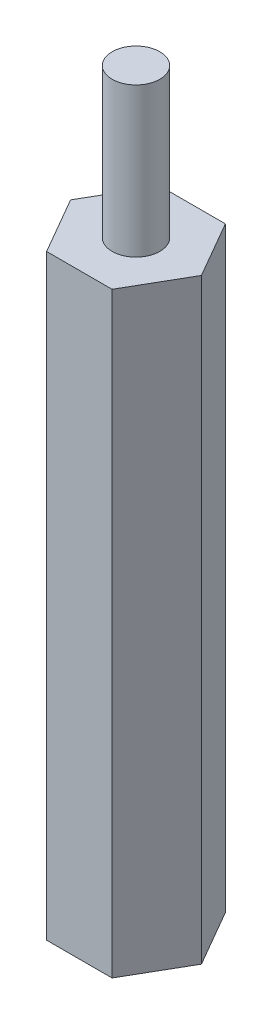
ISO-10303-21;
HEADER;
FILE_DESCRIPTION(('STEP AP214'),'2;1');
FILE_NAME('part.step','',(''),(''),'','','');
FILE_SCHEMA(('AUTOMOTIVE_DESIGN { 1 0 10303 214 1 1 1 1 }'));
ENDSEC;
DATA;
#1=APPLICATION_CONTEXT('core data for automotive mechanical design processes');
#2=APPLICATION_PROTOCOL_DEFINITION('international standard','automotive_design',2000,#1);
#3=PRODUCT_CONTEXT('',#1,'mechanical');
#4=PRODUCT('Part','Part','',(#3));
#5=PRODUCT_RELATED_PRODUCT_CATEGORY('part','',(#4));
#6=PRODUCT_DEFINITION_FORMATION('','',#4);
#7=PRODUCT_DEFINITION_CONTEXT('part definition',#1,'design');
#8=PRODUCT_DEFINITION('design','',#6,#7);
#9=PRODUCT_DEFINITION_SHAPE('','',#8);
#10=(LENGTH_UNIT() NAMED_UNIT(*) SI_UNIT(.MILLI.,.METRE.));
#11=(NAMED_UNIT(*) PLANE_ANGLE_UNIT() SI_UNIT($,.RADIAN.));
#12=(NAMED_UNIT(*) SI_UNIT($,.STERADIAN.) SOLID_ANGLE_UNIT());
#13=UNCERTAINTY_MEASURE_WITH_UNIT(LENGTH_MEASURE(1.E-05),#10,'distance_accuracy_value','');
#14=(GEOMETRIC_REPRESENTATION_CONTEXT(3) GLOBAL_UNCERTAINTY_ASSIGNED_CONTEXT((#13)) GLOBAL_UNIT_ASSIGNED_CONTEXT((#10,
#11,#12)) REPRESENTATION_CONTEXT('',''));
#15=CARTESIAN_POINT('',(0.,0.,0.));
#16=DIRECTION('',(0.,0.,1.));
#17=DIRECTION('',(1.,0.,0.));
#18=AXIS2_PLACEMENT_3D('',#15,#16,#17);
#19=CARTESIAN_POINT('',(-1.39314619955457,25.4,2.413));
#20=DIRECTION('',(0.,0.,-1.));
#21=DIRECTION('',(-1.,0.,0.));
#22=AXIS2_PLACEMENT_3D('',#19,#20,#21);
#23=PLANE('',#22);
#24=DIRECTION('',(1.,0.,0.));
#25=VECTOR('',#24,1.);
#26=CARTESIAN_POINT('',(-1.39314619955457,0.,2.413));
#27=LINE('',#26,#25);
#28=CARTESIAN_POINT('',(-1.39314619955457,0.,2.413));
#29=VERTEX_POINT('',#28);
#30=CARTESIAN_POINT('',(1.39314619955457,0.,2.413));
#31=VERTEX_POINT('',#30);
#32=EDGE_CURVE('E120',#29,#31,#27,.T.);
#33=ORIENTED_EDGE('',*,*,#32,.T.);
#34=DIRECTION('',(0.,-1.,0.));
#35=VECTOR('',#34,1.);
#36=CARTESIAN_POINT('',(1.39314619955457,25.4,2.413));
#37=LINE('',#36,#35);
#38=CARTESIAN_POINT('',(1.39314619955457,25.4,2.413));
#39=VERTEX_POINT('',#38);
#40=EDGE_CURVE('E37',#39,#31,#37,.T.);
#41=ORIENTED_EDGE('',*,*,#40,.F.);
#42=DIRECTION('',(1.,0.,0.));
#43=VECTOR('',#42,1.);
#44=CARTESIAN_POINT('',(-1.39314619955457,25.4,2.413));
#45=LINE('',#44,#43);
#46=CARTESIAN_POINT('',(-1.39314619955457,25.4,2.413));
#47=VERTEX_POINT('',#46);
#48=EDGE_CURVE('E131',#47,#39,#45,.T.);
#49=ORIENTED_EDGE('',*,*,#48,.F.);
#50=DIRECTION('',(0.,-1.,0.));
#51=VECTOR('',#50,1.);
#52=CARTESIAN_POINT('',(-1.39314619955457,25.4,2.413));
#53=LINE('',#52,#51);
#54=EDGE_CURVE('E116',#47,#29,#53,.T.);
#55=ORIENTED_EDGE('',*,*,#54,.T.);
#56=EDGE_LOOP('',(#33,#41,#49,#55));
#57=FACE_BOUND('',#56,.T.);
#58=ADVANCED_FACE('F34',(#57),#23,.F.);
#59=CARTESIAN_POINT('',(1.39314619955457,25.4,2.413));
#60=DIRECTION('',(-0.866025403784438,0.,-0.5));
#61=DIRECTION('',(-0.5,0.,0.866025403784439));
#62=AXIS2_PLACEMENT_3D('',#59,#60,#61);
#63=PLANE('',#62);
#64=DIRECTION('',(0.5,0.,-0.866025403784439));
#65=VECTOR('',#64,1.);
#66=CARTESIAN_POINT('',(1.39314619955457,0.,2.413));
#67=LINE('',#66,#65);
#68=CARTESIAN_POINT('',(2.78629239910913,0.,0.));
#69=VERTEX_POINT('',#68);
#70=EDGE_CURVE('E123',#31,#69,#67,.T.);
#71=ORIENTED_EDGE('',*,*,#70,.T.);
#72=DIRECTION('',(0.,-1.,0.));
#73=VECTOR('',#72,1.);
#74=CARTESIAN_POINT('',(2.78629239910913,25.4,0.));
#75=LINE('',#74,#73);
#76=CARTESIAN_POINT('',(2.78629239910913,25.4,0.));
#77=VERTEX_POINT('',#76);
#78=EDGE_CURVE('E134',#77,#69,#75,.T.);
#79=ORIENTED_EDGE('',*,*,#78,.F.);
#80=DIRECTION('',(0.5,0.,-0.866025403784439));
#81=VECTOR('',#80,1.);
#82=CARTESIAN_POINT('',(1.39314619955457,25.4,2.413));
#83=LINE('',#82,#81);
#84=EDGE_CURVE('E89',#39,#77,#83,.T.);
#85=ORIENTED_EDGE('',*,*,#84,.F.);
#86=ORIENTED_EDGE('',*,*,#40,.T.);
#87=EDGE_LOOP('',(#71,#79,#85,#86));
#88=FACE_BOUND('',#87,.T.);
#89=ADVANCED_FACE('F139',(#88),#63,.F.);
#90=CARTESIAN_POINT('',(2.78629239910913,25.4,0.));
#91=DIRECTION('',(-0.866025403784439,0.,0.5));
#92=DIRECTION('',(0.5,0.,0.866025403784439));
#93=AXIS2_PLACEMENT_3D('',#90,#91,#92);
#94=PLANE('',#93);
#95=DIRECTION('',(-0.5,0.,-0.866025403784439));
#96=VECTOR('',#95,1.);
#97=CARTESIAN_POINT('',(2.78629239910913,0.,0.));
#98=LINE('',#97,#96);
#99=CARTESIAN_POINT('',(1.39314619955457,0.,-2.413));
#100=VERTEX_POINT('',#99);
#101=EDGE_CURVE('E126',#69,#100,#98,.T.);
#102=ORIENTED_EDGE('',*,*,#101,.T.);
#103=DIRECTION('',(0.,-1.,0.));
#104=VECTOR('',#103,1.);
#105=CARTESIAN_POINT('',(1.39314619955457,25.4,-2.413));
#106=LINE('',#105,#104);
#107=CARTESIAN_POINT('',(1.39314619955457,25.4,-2.413));
#108=VERTEX_POINT('',#107);
#109=EDGE_CURVE('E111',#108,#100,#106,.T.);
#110=ORIENTED_EDGE('',*,*,#109,.F.);
#111=DIRECTION('',(-0.5,0.,-0.866025403784439));
#112=VECTOR('',#111,1.);
#113=CARTESIAN_POINT('',(2.78629239910913,25.4,0.));
#114=LINE('',#113,#112);
#115=EDGE_CURVE('E102',#77,#108,#114,.T.);
#116=ORIENTED_EDGE('',*,*,#115,.F.);
#117=ORIENTED_EDGE('',*,*,#78,.T.);
#118=EDGE_LOOP('',(#102,#110,#116,#117));
#119=FACE_BOUND('',#118,.T.);
#120=ADVANCED_FACE('F145',(#119),#94,.F.);
#121=CARTESIAN_POINT('',(1.39314619955457,25.4,-2.413));
#122=DIRECTION('',(0.,0.,1.));
#123=DIRECTION('',(1.,0.,0.));
#124=AXIS2_PLACEMENT_3D('',#121,#122,#123);
#125=PLANE('',#124);
#126=DIRECTION('',(-1.,0.,0.));
#127=VECTOR('',#126,1.);
#128=CARTESIAN_POINT('',(1.39314619955457,0.,-2.413));
#129=LINE('',#128,#127);
#130=CARTESIAN_POINT('',(-1.39314619955457,0.,-2.413));
#131=VERTEX_POINT('',#130);
#132=EDGE_CURVE('E110',#100,#131,#129,.T.);
#133=ORIENTED_EDGE('',*,*,#132,.T.);
#134=DIRECTION('',(0.,-1.,0.));
#135=VECTOR('',#134,1.);
#136=CARTESIAN_POINT('',(-1.39314619955457,25.4,-2.413));
#137=LINE('',#136,#135);
#138=CARTESIAN_POINT('',(-1.39314619955457,25.4,-2.413));
#139=VERTEX_POINT('',#138);
#140=EDGE_CURVE('E107',#139,#131,#137,.T.);
#141=ORIENTED_EDGE('',*,*,#140,.F.);
#142=DIRECTION('',(-1.,0.,0.));
#143=VECTOR('',#142,1.);
#144=CARTESIAN_POINT('',(1.39314619955457,25.4,-2.413));
#145=LINE('',#144,#143);
#146=EDGE_CURVE('E96',#108,#139,#145,.T.);
#147=ORIENTED_EDGE('',*,*,#146,.F.);
#148=ORIENTED_EDGE('',*,*,#109,.T.);
#149=EDGE_LOOP('',(#133,#141,#147,#148));
#150=FACE_BOUND('',#149,.T.);
#151=ADVANCED_FACE('F108',(#150),#125,.F.);
#152=CARTESIAN_POINT('',(-1.39314619955457,25.4,-2.413));
#153=DIRECTION('',(0.866025403784438,0.,0.5));
#154=DIRECTION('',(0.5,0.,-0.866025403784438));
#155=AXIS2_PLACEMENT_3D('',#152,#153,#154);
#156=PLANE('',#155);
#157=DIRECTION('',(-0.5,0.,0.866025403784438));
#158=VECTOR('',#157,1.);
#159=CARTESIAN_POINT('',(-1.39314619955457,0.,-2.413));
#160=LINE('',#159,#158);
#161=CARTESIAN_POINT('',(-2.78629239910913,0.,0.));
#162=VERTEX_POINT('',#161);
#163=EDGE_CURVE('E74',#131,#162,#160,.T.);
#164=ORIENTED_EDGE('',*,*,#163,.T.);
#165=DIRECTION('',(0.,-1.,0.));
#166=VECTOR('',#165,1.);
#167=CARTESIAN_POINT('',(-2.78629239910913,25.4,0.));
#168=LINE('',#167,#166);
#169=CARTESIAN_POINT('',(-2.78629239910913,25.4,0.));
#170=VERTEX_POINT('',#169);
#171=EDGE_CURVE('E112',#170,#162,#168,.T.);
#172=ORIENTED_EDGE('',*,*,#171,.F.);
#173=DIRECTION('',(-0.5,0.,0.866025403784438));
#174=VECTOR('',#173,1.);
#175=CARTESIAN_POINT('',(-1.39314619955457,25.4,-2.413));
#176=LINE('',#175,#174);
#177=EDGE_CURVE('E100',#139,#170,#176,.T.);
#178=ORIENTED_EDGE('',*,*,#177,.F.);
#179=ORIENTED_EDGE('',*,*,#140,.T.);
#180=EDGE_LOOP('',(#164,#172,#178,#179));
#181=FACE_BOUND('',#180,.T.);
#182=ADVANCED_FACE('F114',(#181),#156,.F.);
#183=CARTESIAN_POINT('',(-2.78629239910913,25.4,0.));
#184=DIRECTION('',(0.866025403784439,0.,-0.5));
#185=DIRECTION('',(-0.5,0.,-0.866025403784439));
#186=AXIS2_PLACEMENT_3D('',#183,#184,#185);
#187=PLANE('',#186);
#188=DIRECTION('',(0.5,0.,0.866025403784439));
#189=VECTOR('',#188,1.);
#190=CARTESIAN_POINT('',(-2.78629239910913,0.,0.));
#191=LINE('',#190,#189);
#192=EDGE_CURVE('E80',#162,#29,#191,.T.);
#193=ORIENTED_EDGE('',*,*,#192,.T.);
#194=ORIENTED_EDGE('',*,*,#54,.F.);
#195=DIRECTION('',(0.5,0.,0.866025403784439));
#196=VECTOR('',#195,1.);
#197=CARTESIAN_POINT('',(-2.78629239910913,25.4,0.));
#198=LINE('',#197,#196);
#199=EDGE_CURVE('E51',#170,#47,#198,.T.);
#200=ORIENTED_EDGE('',*,*,#199,.F.);
#201=ORIENTED_EDGE('',*,*,#171,.T.);
#202=EDGE_LOOP('',(#193,#194,#200,#201));
#203=FACE_BOUND('',#202,.T.);
#204=ADVANCED_FACE('F176',(#203),#187,.F.);
#205=CARTESIAN_POINT('',(0.,25.4,0.));
#206=DIRECTION('',(0.,1.,0.));
#207=DIRECTION('',(0.,0.,1.));
#208=AXIS2_PLACEMENT_3D('',#205,#206,#207);
#209=PLANE('',#208);
#210=CARTESIAN_POINT('',(0.,25.4,0.));
#211=DIRECTION('',(0.,1.,0.));
#212=DIRECTION('',(0.,0.,1.));
#213=AXIS2_PLACEMENT_3D('',#210,#211,#212);
#214=CIRCLE('',#213,1.016);
#215=CARTESIAN_POINT('',(0.,25.4,1.016));
#216=VERTEX_POINT('',#215);
#217=EDGE_CURVE('E11',#216,#216,#214,.T.);
#218=ORIENTED_EDGE('',*,*,#217,.F.);
#219=EDGE_LOOP('',(#218));
#220=FACE_BOUND('',#219,.T.);
#221=ORIENTED_EDGE('',*,*,#48,.T.);
#222=ORIENTED_EDGE('',*,*,#84,.T.);
#223=ORIENTED_EDGE('',*,*,#115,.T.);
#224=ORIENTED_EDGE('',*,*,#146,.T.);
#225=ORIENTED_EDGE('',*,*,#177,.T.);
#226=ORIENTED_EDGE('',*,*,#199,.T.);
#227=EDGE_LOOP('',(#221,#222,#223,#224,#225,#226));
#228=FACE_BOUND('',#227,.T.);
#229=ADVANCED_FACE('F98',(#220,#228),#209,.T.);
#230=CARTESIAN_POINT('',(0.,0.,0.));
#231=DIRECTION('',(0.,1.,0.));
#232=DIRECTION('',(0.,0.,1.));
#233=AXIS2_PLACEMENT_3D('',#230,#231,#232);
#234=PLANE('',#233);
#235=CARTESIAN_POINT('',(0.,0.,0.));
#236=DIRECTION('',(0.,-1.,0.));
#237=DIRECTION('',(0.,0.,-1.));
#238=AXIS2_PLACEMENT_3D('',#235,#236,#237);
#239=CIRCLE('',#238,1.016);
#240=CARTESIAN_POINT('',(0.,0.,-1.016));
#241=VERTEX_POINT('',#240);
#242=EDGE_CURVE('E152',#241,#241,#239,.T.);
#243=ORIENTED_EDGE('',*,*,#242,.F.);
#244=EDGE_LOOP('',(#243));
#245=FACE_BOUND('',#244,.T.);
#246=ORIENTED_EDGE('',*,*,#32,.F.);
#247=ORIENTED_EDGE('',*,*,#192,.F.);
#248=ORIENTED_EDGE('',*,*,#163,.F.);
#249=ORIENTED_EDGE('',*,*,#132,.F.);
#250=ORIENTED_EDGE('',*,*,#101,.F.);
#251=ORIENTED_EDGE('',*,*,#70,.F.);
#252=EDGE_LOOP('',(#246,#247,#248,#249,#250,#251));
#253=FACE_BOUND('',#252,.T.);
#254=ADVANCED_FACE('F144',(#245,#253),#234,.F.);
#255=CARTESIAN_POINT('',(0.,31.75,0.));
#256=DIRECTION('',(0.,-1.,0.));
#257=DIRECTION('',(0.,0.,-1.));
#258=AXIS2_PLACEMENT_3D('',#255,#256,#257);
#259=CYLINDRICAL_SURFACE('',#258,1.016);
#260=CARTESIAN_POINT('',(0.,31.75,0.));
#261=DIRECTION('',(0.,1.,0.));
#262=DIRECTION('',(0.,0.,1.));
#263=AXIS2_PLACEMENT_3D('',#260,#261,#262);
#264=CIRCLE('',#263,1.016);
#265=CARTESIAN_POINT('',(0.,31.75,1.016));
#266=VERTEX_POINT('',#265);
#267=EDGE_CURVE('E124',#266,#266,#264,.T.);
#268=ORIENTED_EDGE('',*,*,#267,.F.);
#269=EDGE_LOOP('',(#268));
#270=FACE_BOUND('',#269,.T.);
#271=ORIENTED_EDGE('',*,*,#217,.T.);
#272=EDGE_LOOP('',(#271));
#273=FACE_BOUND('',#272,.T.);
#274=ADVANCED_FACE('F168',(#270,#273),#259,.T.);
#275=CARTESIAN_POINT('',(0.,31.75,0.));
#276=DIRECTION('',(0.,1.,0.));
#277=DIRECTION('',(0.,0.,1.));
#278=AXIS2_PLACEMENT_3D('',#275,#276,#277);
#279=PLANE('',#278);
#280=ORIENTED_EDGE('',*,*,#267,.T.);
#281=EDGE_LOOP('',(#280));
#282=FACE_BOUND('',#281,.T.);
#283=ADVANCED_FACE('F163',(#282),#279,.T.);
#284=CARTESIAN_POINT('',(0.,6.35,0.));
#285=DIRECTION('',(0.,-1.,0.));
#286=DIRECTION('',(0.,0.,-1.));
#287=AXIS2_PLACEMENT_3D('',#284,#285,#286);
#288=CYLINDRICAL_SURFACE('',#287,1.016);
#289=CARTESIAN_POINT('',(0.,6.35,0.));
#290=DIRECTION('',(0.,-1.,0.));
#291=DIRECTION('',(0.,0.,-1.));
#292=AXIS2_PLACEMENT_3D('',#289,#290,#291);
#293=CIRCLE('',#292,1.016);
#294=CARTESIAN_POINT('',(0.,6.35,-1.016));
#295=VERTEX_POINT('',#294);
#296=EDGE_CURVE('E151',#295,#295,#293,.T.);
#297=ORIENTED_EDGE('',*,*,#296,.F.);
#298=EDGE_LOOP('',(#297));
#299=FACE_BOUND('',#298,.T.);
#300=ORIENTED_EDGE('',*,*,#242,.T.);
#301=EDGE_LOOP('',(#300));
#302=FACE_BOUND('',#301,.T.);
#303=ADVANCED_FACE('F160',(#299,#302),#288,.F.);
#304=CARTESIAN_POINT('',(0.,6.35,0.));
#305=DIRECTION('',(0.,-1.,0.));
#306=DIRECTION('',(0.,0.,-1.));
#307=AXIS2_PLACEMENT_3D('',#304,#305,#306);
#308=PLANE('',#307);
#309=ORIENTED_EDGE('',*,*,#296,.T.);
#310=EDGE_LOOP('',(#309));
#311=FACE_BOUND('',#310,.T.);
#312=ADVANCED_FACE('F158',(#311),#308,.T.);
#313=CLOSED_SHELL('',(#58,#89,#120,#151,#182,#204,#229,#254,#274,#283,#303,#312));
#314=MANIFOLD_SOLID_BREP('B2',#313);
#315=ADVANCED_BREP_SHAPE_REPRESENTATION('',(#18,#314),#14);
#316=SHAPE_DEFINITION_REPRESENTATION(#9,#315);
ENDSEC;
END-ISO-10303-21;
